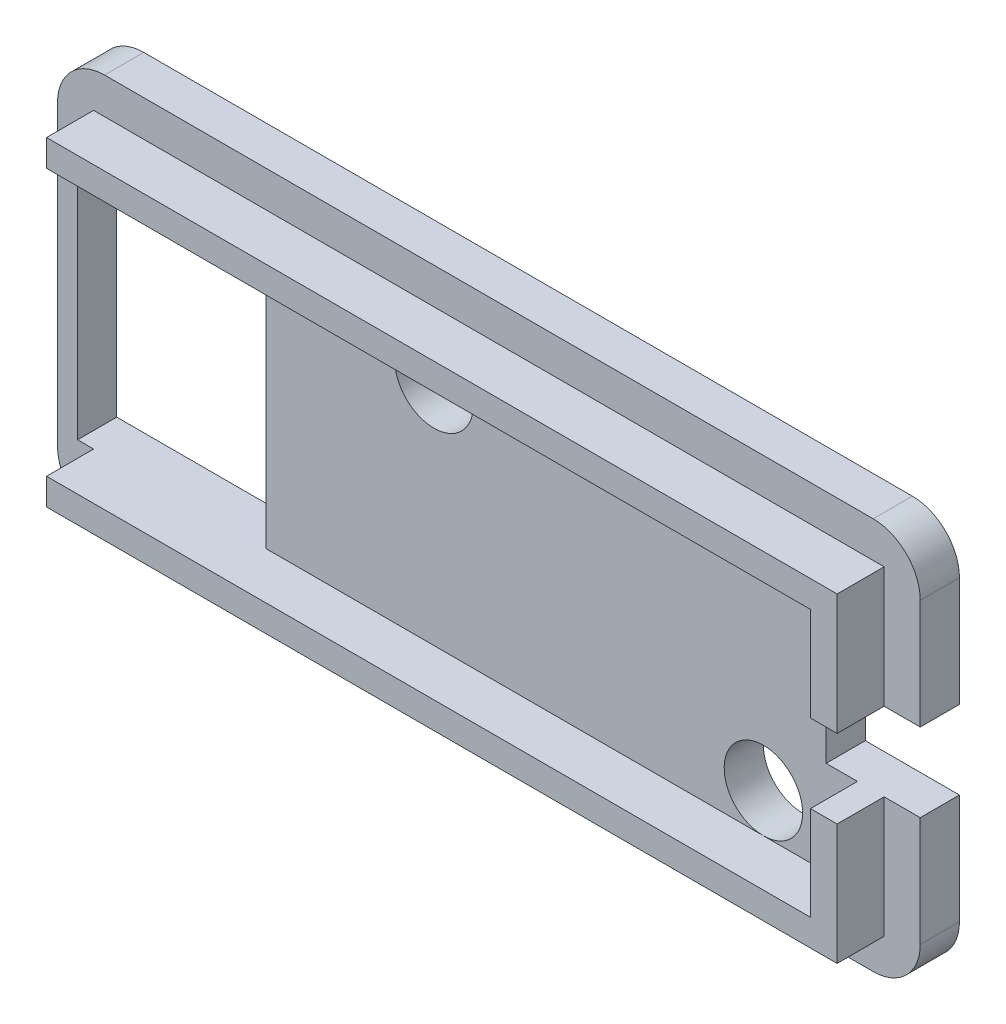
ISO-10303-21;
HEADER;
FILE_DESCRIPTION(('STEP AP214'),'2;1');
FILE_NAME('part.step','',(''),(''),'','','');
FILE_SCHEMA(('AUTOMOTIVE_DESIGN { 1 0 10303 214 1 1 1 1 }'));
ENDSEC;
DATA;
#1=APPLICATION_CONTEXT('core data for automotive mechanical design processes');
#2=APPLICATION_PROTOCOL_DEFINITION('international standard','automotive_design',2000,#1);
#3=PRODUCT_CONTEXT('',#1,'mechanical');
#4=PRODUCT('Part','Part','',(#3));
#5=PRODUCT_RELATED_PRODUCT_CATEGORY('part','',(#4));
#6=PRODUCT_DEFINITION_FORMATION('','',#4);
#7=PRODUCT_DEFINITION_CONTEXT('part definition',#1,'design');
#8=PRODUCT_DEFINITION('design','',#6,#7);
#9=PRODUCT_DEFINITION_SHAPE('','',#8);
#10=(LENGTH_UNIT() NAMED_UNIT(*) SI_UNIT(.MILLI.,.METRE.));
#11=(NAMED_UNIT(*) PLANE_ANGLE_UNIT() SI_UNIT($,.RADIAN.));
#12=(NAMED_UNIT(*) SI_UNIT($,.STERADIAN.) SOLID_ANGLE_UNIT());
#13=UNCERTAINTY_MEASURE_WITH_UNIT(LENGTH_MEASURE(1.E-05),#10,'distance_accuracy_value','');
#14=(GEOMETRIC_REPRESENTATION_CONTEXT(3) GLOBAL_UNCERTAINTY_ASSIGNED_CONTEXT((#13)) GLOBAL_UNIT_ASSIGNED_CONTEXT((#10,
#11,#12)) REPRESENTATION_CONTEXT('',''));
#15=CARTESIAN_POINT('',(0.,0.,0.));
#16=DIRECTION('',(0.,0.,1.));
#17=DIRECTION('',(1.,0.,0.));
#18=AXIS2_PLACEMENT_3D('',#15,#16,#17);
#19=CARTESIAN_POINT('',(0.,0.,5.5));
#20=DIRECTION('',(0.,0.,-1.));
#21=DIRECTION('',(-1.,0.,0.));
#22=AXIS2_PLACEMENT_3D('',#19,#20,#21);
#23=PLANE('',#22);
#24=DIRECTION('',(0.,1.,0.));
#25=VECTOR('',#24,1.);
#26=CARTESIAN_POINT('',(25.2,10.2,5.5));
#27=LINE('',#26,#25);
#28=CARTESIAN_POINT('',(25.2,2.5,5.5));
#29=VERTEX_POINT('',#28);
#30=CARTESIAN_POINT('',(25.2,10.2,5.5));
#31=VERTEX_POINT('',#30);
#32=EDGE_CURVE('E81',#29,#31,#27,.T.);
#33=ORIENTED_EDGE('',*,*,#32,.T.);
#34=DIRECTION('',(-1.,0.,0.));
#35=VECTOR('',#34,1.);
#36=CARTESIAN_POINT('',(-25.2,10.2,5.5));
#37=LINE('',#36,#35);
#38=CARTESIAN_POINT('',(-25.2,10.2,5.5));
#39=VERTEX_POINT('',#38);
#40=EDGE_CURVE('E274',#31,#39,#37,.T.);
#41=ORIENTED_EDGE('',*,*,#40,.T.);
#42=DIRECTION('',(0.,-1.,0.));
#43=VECTOR('',#42,1.);
#44=CARTESIAN_POINT('',(-25.2,10.2,5.5));
#45=LINE('',#44,#43);
#46=CARTESIAN_POINT('',(-25.2,8.5,5.5));
#47=VERTEX_POINT('',#46);
#48=EDGE_CURVE('E301',#39,#47,#45,.T.);
#49=ORIENTED_EDGE('',*,*,#48,.T.);
#50=DIRECTION('',(1.,0.,0.));
#51=VECTOR('',#50,1.);
#52=CARTESIAN_POINT('',(-23.5,8.5,5.5));
#53=LINE('',#52,#51);
#54=CARTESIAN_POINT('',(23.5,8.5,5.5));
#55=VERTEX_POINT('',#54);
#56=EDGE_CURVE('E416',#47,#55,#53,.T.);
#57=ORIENTED_EDGE('',*,*,#56,.T.);
#58=DIRECTION('',(0.,-1.,0.));
#59=VECTOR('',#58,1.);
#60=CARTESIAN_POINT('',(23.5,8.5,5.5));
#61=LINE('',#60,#59);
#62=CARTESIAN_POINT('',(23.5,2.5,5.5));
#63=VERTEX_POINT('',#62);
#64=EDGE_CURVE('E421',#55,#63,#61,.T.);
#65=ORIENTED_EDGE('',*,*,#64,.T.);
#66=DIRECTION('',(1.,0.,0.));
#67=VECTOR('',#66,1.);
#68=CARTESIAN_POINT('',(0.,2.5,5.5));
#69=LINE('',#68,#67);
#70=EDGE_CURVE('E372',#63,#29,#69,.T.);
#71=ORIENTED_EDGE('',*,*,#70,.T.);
#72=EDGE_LOOP('',(#33,#41,#49,#57,#65,#71));
#73=FACE_BOUND('',#72,.T.);
#74=ADVANCED_FACE('F65',(#73),#23,.F.);
#75=CARTESIAN_POINT('',(25.2,-10.2,5.5));
#76=VERTEX_POINT('',#75);
#77=CARTESIAN_POINT('',(25.2,-2.5,5.5));
#78=VERTEX_POINT('',#77);
#79=EDGE_CURVE('E294',#76,#78,#27,.T.);
#80=ORIENTED_EDGE('',*,*,#79,.T.);
#81=DIRECTION('',(-1.,0.,0.));
#82=VECTOR('',#81,1.);
#83=CARTESIAN_POINT('',(0.,-2.5,5.5));
#84=LINE('',#83,#82);
#85=CARTESIAN_POINT('',(23.5,-2.5,5.5));
#86=VERTEX_POINT('',#85);
#87=EDGE_CURVE('E363',#78,#86,#84,.T.);
#88=ORIENTED_EDGE('',*,*,#87,.T.);
#89=CARTESIAN_POINT('',(23.5,-8.5,5.5));
#90=VERTEX_POINT('',#89);
#91=EDGE_CURVE('E419',#86,#90,#61,.T.);
#92=ORIENTED_EDGE('',*,*,#91,.T.);
#93=DIRECTION('',(1.,0.,0.));
#94=VECTOR('',#93,1.);
#95=CARTESIAN_POINT('',(-23.5,-8.5,5.5));
#96=LINE('',#95,#94);
#97=CARTESIAN_POINT('',(-25.2,-8.5,5.5));
#98=VERTEX_POINT('',#97);
#99=EDGE_CURVE('E425',#98,#90,#96,.T.);
#100=ORIENTED_EDGE('',*,*,#99,.F.);
#101=CARTESIAN_POINT('',(-25.2,-10.2,5.5));
#102=VERTEX_POINT('',#101);
#103=EDGE_CURVE('E300',#98,#102,#45,.T.);
#104=ORIENTED_EDGE('',*,*,#103,.T.);
#105=DIRECTION('',(1.,0.,0.));
#106=VECTOR('',#105,1.);
#107=CARTESIAN_POINT('',(-25.2,-10.2,5.5));
#108=LINE('',#107,#106);
#109=EDGE_CURVE('E267',#102,#76,#108,.T.);
#110=ORIENTED_EDGE('',*,*,#109,.T.);
#111=EDGE_LOOP('',(#80,#88,#92,#100,#104,#110));
#112=FACE_BOUND('',#111,.T.);
#113=ADVANCED_FACE('F563',(#112),#23,.F.);
#114=CARTESIAN_POINT('',(-23.5,8.5,5.5));
#115=DIRECTION('',(0.,1.,0.));
#116=DIRECTION('',(0.,0.,1.));
#117=AXIS2_PLACEMENT_3D('',#114,#115,#116);
#118=PLANE('',#117);
#119=DIRECTION('',(0.,0.,1.));
#120=VECTOR('',#119,1.);
#121=CARTESIAN_POINT('',(-25.2,8.5,5.5));
#122=LINE('',#121,#120);
#123=CARTESIAN_POINT('',(-25.2,8.5,2.5));
#124=VERTEX_POINT('',#123);
#125=EDGE_CURVE('E318',#124,#47,#122,.T.);
#126=ORIENTED_EDGE('',*,*,#125,.F.);
#127=DIRECTION('',(-1.,0.,0.));
#128=VECTOR('',#127,1.);
#129=CARTESIAN_POINT('',(0.,8.5,2.5));
#130=LINE('',#129,#128);
#131=CARTESIAN_POINT('',(-26.2250049917796,8.5,2.5));
#132=VERTEX_POINT('',#131);
#133=EDGE_CURVE('E394',#124,#132,#130,.T.);
#134=ORIENTED_EDGE('',*,*,#133,.T.);
#135=DIRECTION('',(0.,0.,-1.));
#136=VECTOR('',#135,1.);
#137=CARTESIAN_POINT('',(-26.2250049917796,8.5,13.5));
#138=LINE('',#137,#136);
#139=CARTESIAN_POINT('',(-26.2250049917796,8.5,0.));
#140=VERTEX_POINT('',#139);
#141=EDGE_CURVE('E379',#132,#140,#138,.T.);
#142=ORIENTED_EDGE('',*,*,#141,.T.);
#143=DIRECTION('',(-1.,0.,0.));
#144=VECTOR('',#143,1.);
#145=CARTESIAN_POINT('',(0.,8.5,0.));
#146=LINE('',#145,#144);
#147=CARTESIAN_POINT('',(-14.2250049917796,8.5,0.));
#148=VERTEX_POINT('',#147);
#149=EDGE_CURVE('E397',#148,#140,#146,.T.);
#150=ORIENTED_EDGE('',*,*,#149,.F.);
#151=DIRECTION('',(0.,0.,-1.));
#152=VECTOR('',#151,1.);
#153=CARTESIAN_POINT('',(-14.2250049917796,8.5,13.5));
#154=LINE('',#153,#152);
#155=CARTESIAN_POINT('',(-14.2250049917796,8.5,2.5));
#156=VERTEX_POINT('',#155);
#157=EDGE_CURVE('E382',#156,#148,#154,.T.);
#158=ORIENTED_EDGE('',*,*,#157,.F.);
#159=DIRECTION('',(1.,0.,0.));
#160=VECTOR('',#159,1.);
#161=CARTESIAN_POINT('',(-23.5,8.5,2.5));
#162=LINE('',#161,#160);
#163=CARTESIAN_POINT('',(-3.49999999999999,8.5,2.5));
#164=VERTEX_POINT('',#163);
#165=EDGE_CURVE('E429',#156,#164,#162,.T.);
#166=ORIENTED_EDGE('',*,*,#165,.T.);
#167=CARTESIAN_POINT('',(23.5,8.5,2.5));
#168=VERTEX_POINT('',#167);
#169=EDGE_CURVE('E415',#164,#168,#162,.T.);
#170=ORIENTED_EDGE('',*,*,#169,.T.);
#171=DIRECTION('',(0.,0.,-1.));
#172=VECTOR('',#171,1.);
#173=CARTESIAN_POINT('',(23.5,8.5,5.5));
#174=LINE('',#173,#172);
#175=EDGE_CURVE('E428',#55,#168,#174,.T.);
#176=ORIENTED_EDGE('',*,*,#175,.F.);
#177=ORIENTED_EDGE('',*,*,#56,.F.);
#178=EDGE_LOOP('',(#126,#134,#142,#150,#158,#166,#170,#176,#177));
#179=FACE_BOUND('',#178,.T.);
#180=ADVANCED_FACE('F586',(#179),#118,.F.);
#181=CARTESIAN_POINT('',(-23.5,-8.5,5.5));
#182=DIRECTION('',(0.,1.,0.));
#183=DIRECTION('',(-1.,0.,0.));
#184=AXIS2_PLACEMENT_3D('',#181,#182,#183);
#185=PLANE('',#184);
#186=DIRECTION('',(1.,0.,0.));
#187=VECTOR('',#186,1.);
#188=CARTESIAN_POINT('',(0.,-8.5,2.5));
#189=LINE('',#188,#187);
#190=CARTESIAN_POINT('',(-26.2250049917796,-8.5,2.5));
#191=VERTEX_POINT('',#190);
#192=CARTESIAN_POINT('',(-25.2,-8.5,2.5));
#193=VERTEX_POINT('',#192);
#194=EDGE_CURVE('E405',#191,#193,#189,.T.);
#195=ORIENTED_EDGE('',*,*,#194,.T.);
#196=DIRECTION('',(0.,0.,1.));
#197=VECTOR('',#196,1.);
#198=CARTESIAN_POINT('',(-25.2,-8.5,5.5));
#199=LINE('',#198,#197);
#200=EDGE_CURVE('E12',#193,#98,#199,.T.);
#201=ORIENTED_EDGE('',*,*,#200,.T.);
#202=ORIENTED_EDGE('',*,*,#99,.T.);
#203=DIRECTION('',(0.,0.,-1.));
#204=VECTOR('',#203,1.);
#205=CARTESIAN_POINT('',(23.5,-8.5,5.5));
#206=LINE('',#205,#204);
#207=CARTESIAN_POINT('',(23.5,-8.5,2.5));
#208=VERTEX_POINT('',#207);
#209=EDGE_CURVE('E442',#90,#208,#206,.T.);
#210=ORIENTED_EDGE('',*,*,#209,.T.);
#211=DIRECTION('',(1.,0.,0.));
#212=VECTOR('',#211,1.);
#213=CARTESIAN_POINT('',(-23.5,-8.5,2.5));
#214=LINE('',#213,#212);
#215=CARTESIAN_POINT('',(17.5,-8.5,2.5));
#216=VERTEX_POINT('',#215);
#217=EDGE_CURVE('E438',#216,#208,#214,.T.);
#218=ORIENTED_EDGE('',*,*,#217,.F.);
#219=CARTESIAN_POINT('',(-14.2250049917796,-8.5,2.5));
#220=VERTEX_POINT('',#219);
#221=EDGE_CURVE('E420',#220,#216,#214,.T.);
#222=ORIENTED_EDGE('',*,*,#221,.F.);
#223=DIRECTION('',(0.,0.,-1.));
#224=VECTOR('',#223,1.);
#225=CARTESIAN_POINT('',(-14.2250049917796,-8.5,13.5));
#226=LINE('',#225,#224);
#227=CARTESIAN_POINT('',(-14.2250049917796,-8.5,0.));
#228=VERTEX_POINT('',#227);
#229=EDGE_CURVE('E386',#220,#228,#226,.T.);
#230=ORIENTED_EDGE('',*,*,#229,.T.);
#231=DIRECTION('',(1.,0.,0.));
#232=VECTOR('',#231,1.);
#233=CARTESIAN_POINT('',(0.,-8.5,0.));
#234=LINE('',#233,#232);
#235=CARTESIAN_POINT('',(-26.2250049917796,-8.5,0.));
#236=VERTEX_POINT('',#235);
#237=EDGE_CURVE('E408',#236,#228,#234,.T.);
#238=ORIENTED_EDGE('',*,*,#237,.F.);
#239=DIRECTION('',(0.,0.,-1.));
#240=VECTOR('',#239,1.);
#241=CARTESIAN_POINT('',(-26.2250049917796,-8.5,13.5));
#242=LINE('',#241,#240);
#243=EDGE_CURVE('E390',#191,#236,#242,.T.);
#244=ORIENTED_EDGE('',*,*,#243,.F.);
#245=EDGE_LOOP('',(#195,#201,#202,#210,#218,#222,#230,#238,#244));
#246=FACE_BOUND('',#245,.T.);
#247=ADVANCED_FACE('F608',(#246),#185,.T.);
#248=CARTESIAN_POINT('',(21.5,2.5,8.));
#249=DIRECTION('',(0.,1.,0.));
#250=DIRECTION('',(-1.,0.,0.));
#251=AXIS2_PLACEMENT_3D('',#248,#249,#250);
#252=PLANE('',#251);
#253=DIRECTION('',(1.,0.,0.));
#254=VECTOR('',#253,1.);
#255=CARTESIAN_POINT('',(0.,2.5,2.5));
#256=LINE('',#255,#254);
#257=CARTESIAN_POINT('',(25.2,2.5,2.5));
#258=VERTEX_POINT('',#257);
#259=CARTESIAN_POINT('',(27.5,2.49999999999999,2.5));
#260=VERTEX_POINT('',#259);
#261=EDGE_CURVE('E376',#258,#260,#256,.T.);
#262=ORIENTED_EDGE('',*,*,#261,.F.);
#263=DIRECTION('',(0.,0.,-1.));
#264=VECTOR('',#263,1.);
#265=CARTESIAN_POINT('',(25.2,2.5,8.));
#266=LINE('',#265,#264);
#267=EDGE_CURVE('E262',#29,#258,#266,.T.);
#268=ORIENTED_EDGE('',*,*,#267,.F.);
#269=ORIENTED_EDGE('',*,*,#70,.F.);
#270=DIRECTION('',(0.,0.,1.));
#271=VECTOR('',#270,1.);
#272=CARTESIAN_POINT('',(23.5,2.5,5.5));
#273=LINE('',#272,#271);
#274=CARTESIAN_POINT('',(23.5,2.5,2.5));
#275=VERTEX_POINT('',#274);
#276=EDGE_CURVE('E548',#275,#63,#273,.T.);
#277=ORIENTED_EDGE('',*,*,#276,.F.);
#278=DIRECTION('',(1.,0.,0.));
#279=VECTOR('',#278,1.);
#280=CARTESIAN_POINT('',(0.,2.5,2.5));
#281=LINE('',#280,#279);
#282=CARTESIAN_POINT('',(21.5,2.5,2.5));
#283=VERTEX_POINT('',#282);
#284=EDGE_CURVE('E368',#283,#275,#281,.T.);
#285=ORIENTED_EDGE('',*,*,#284,.F.);
#286=DIRECTION('',(0.,0.,-1.));
#287=VECTOR('',#286,1.);
#288=CARTESIAN_POINT('',(21.5,2.5,8.));
#289=LINE('',#288,#287);
#290=CARTESIAN_POINT('',(21.5,2.5,0.));
#291=VERTEX_POINT('',#290);
#292=EDGE_CURVE('E352',#283,#291,#289,.T.);
#293=ORIENTED_EDGE('',*,*,#292,.T.);
#294=DIRECTION('',(1.,0.,0.));
#295=VECTOR('',#294,1.);
#296=CARTESIAN_POINT('',(21.5,2.5,0.));
#297=LINE('',#296,#295);
#298=CARTESIAN_POINT('',(27.5,2.49999999999999,0.));
#299=VERTEX_POINT('',#298);
#300=EDGE_CURVE('E343',#291,#299,#297,.T.);
#301=ORIENTED_EDGE('',*,*,#300,.T.);
#302=DIRECTION('',(0.,0.,-1.));
#303=VECTOR('',#302,1.);
#304=CARTESIAN_POINT('',(27.5,2.49999999999999,8.));
#305=LINE('',#304,#303);
#306=EDGE_CURVE('E347',#260,#299,#305,.T.);
#307=ORIENTED_EDGE('',*,*,#306,.F.);
#308=EDGE_LOOP('',(#262,#268,#269,#277,#285,#293,#301,#307));
#309=FACE_BOUND('',#308,.T.);
#310=ADVANCED_FACE('F694',(#309),#252,.F.);
#311=CARTESIAN_POINT('',(21.5,-2.5,8.));
#312=DIRECTION('',(0.,-1.,0.));
#313=DIRECTION('',(1.,0.,0.));
#314=AXIS2_PLACEMENT_3D('',#311,#312,#313);
#315=PLANE('',#314);
#316=DIRECTION('',(0.,0.,1.));
#317=VECTOR('',#316,1.);
#318=CARTESIAN_POINT('',(25.2,-2.5,8.));
#319=LINE('',#318,#317);
#320=CARTESIAN_POINT('',(25.2,-2.5,2.5));
#321=VERTEX_POINT('',#320);
#322=EDGE_CURVE('E74',#321,#78,#319,.T.);
#323=ORIENTED_EDGE('',*,*,#322,.F.);
#324=DIRECTION('',(-1.,0.,0.));
#325=VECTOR('',#324,1.);
#326=CARTESIAN_POINT('',(0.,-2.5,2.5));
#327=LINE('',#326,#325);
#328=CARTESIAN_POINT('',(27.5,-2.50000000000001,2.5));
#329=VERTEX_POINT('',#328);
#330=EDGE_CURVE('E89',#329,#321,#327,.T.);
#331=ORIENTED_EDGE('',*,*,#330,.F.);
#332=DIRECTION('',(0.,0.,-1.));
#333=VECTOR('',#332,1.);
#334=CARTESIAN_POINT('',(27.5,-2.50000000000001,8.));
#335=LINE('',#334,#333);
#336=CARTESIAN_POINT('',(27.5,-2.50000000000001,0.));
#337=VERTEX_POINT('',#336);
#338=EDGE_CURVE('E346',#329,#337,#335,.T.);
#339=ORIENTED_EDGE('',*,*,#338,.T.);
#340=DIRECTION('',(-1.,0.,0.));
#341=VECTOR('',#340,1.);
#342=CARTESIAN_POINT('',(21.5,-2.5,0.));
#343=LINE('',#342,#341);
#344=CARTESIAN_POINT('',(21.5,-2.5,0.));
#345=VERTEX_POINT('',#344);
#346=EDGE_CURVE('E326',#337,#345,#343,.T.);
#347=ORIENTED_EDGE('',*,*,#346,.T.);
#348=DIRECTION('',(0.,0.,-1.));
#349=VECTOR('',#348,1.);
#350=CARTESIAN_POINT('',(21.5,-2.5,8.));
#351=LINE('',#350,#349);
#352=CARTESIAN_POINT('',(21.5,-2.5,2.5));
#353=VERTEX_POINT('',#352);
#354=EDGE_CURVE('E355',#353,#345,#351,.T.);
#355=ORIENTED_EDGE('',*,*,#354,.F.);
#356=DIRECTION('',(-1.,0.,0.));
#357=VECTOR('',#356,1.);
#358=CARTESIAN_POINT('',(0.,-2.5,2.5));
#359=LINE('',#358,#357);
#360=CARTESIAN_POINT('',(23.5,-2.5,2.5));
#361=VERTEX_POINT('',#360);
#362=EDGE_CURVE('E351',#361,#353,#359,.T.);
#363=ORIENTED_EDGE('',*,*,#362,.F.);
#364=DIRECTION('',(0.,0.,-1.));
#365=VECTOR('',#364,1.);
#366=CARTESIAN_POINT('',(23.5,-2.5,5.5));
#367=LINE('',#366,#365);
#368=EDGE_CURVE('E544',#86,#361,#367,.T.);
#369=ORIENTED_EDGE('',*,*,#368,.F.);
#370=ORIENTED_EDGE('',*,*,#87,.F.);
#371=EDGE_LOOP('',(#323,#331,#339,#347,#355,#363,#369,#370));
#372=FACE_BOUND('',#371,.T.);
#373=ADVANCED_FACE('F568',(#372),#315,.F.);
#374=CARTESIAN_POINT('',(27.5,12.5,2.5));
#375=DIRECTION('',(1.,0.,0.));
#376=DIRECTION('',(0.,0.,-1.));
#377=AXIS2_PLACEMENT_3D('',#374,#375,#376);
#378=PLANE('',#377);
#379=ORIENTED_EDGE('',*,*,#306,.T.);
#380=DIRECTION('',(0.,-1.,0.));
#381=VECTOR('',#380,1.);
#382=CARTESIAN_POINT('',(27.5,12.5,0.));
#383=LINE('',#382,#381);
#384=CARTESIAN_POINT('',(27.5,9.5,0.));
#385=VERTEX_POINT('',#384);
#386=EDGE_CURVE('E473',#385,#299,#383,.T.);
#387=ORIENTED_EDGE('',*,*,#386,.F.);
#388=DIRECTION('',(0.,0.,-1.));
#389=VECTOR('',#388,1.);
#390=CARTESIAN_POINT('',(27.5,9.5,2.5));
#391=LINE('',#390,#389);
#392=CARTESIAN_POINT('',(27.5,9.5,2.5));
#393=VERTEX_POINT('',#392);
#394=EDGE_CURVE('E529',#385,#393,#391,.F.);
#395=ORIENTED_EDGE('',*,*,#394,.T.);
#396=DIRECTION('',(0.,-1.,0.));
#397=VECTOR('',#396,1.);
#398=CARTESIAN_POINT('',(27.5,12.5,2.5));
#399=LINE('',#398,#397);
#400=EDGE_CURVE('E456',#393,#260,#399,.T.);
#401=ORIENTED_EDGE('',*,*,#400,.T.);
#402=EDGE_LOOP('',(#379,#387,#395,#401));
#403=FACE_BOUND('',#402,.T.);
#404=ADVANCED_FACE('F649',(#403),#378,.T.);
#405=CARTESIAN_POINT('',(23.5,8.5,5.5));
#406=DIRECTION('',(1.,0.,0.));
#407=DIRECTION('',(0.,0.,-1.));
#408=AXIS2_PLACEMENT_3D('',#405,#406,#407);
#409=PLANE('',#408);
#410=DIRECTION('',(0.,-1.,0.));
#411=VECTOR('',#410,1.);
#412=CARTESIAN_POINT('',(23.5,8.5,2.5));
#413=LINE('',#412,#411);
#414=EDGE_CURVE('E434',#168,#275,#413,.T.);
#415=ORIENTED_EDGE('',*,*,#414,.T.);
#416=ORIENTED_EDGE('',*,*,#276,.T.);
#417=ORIENTED_EDGE('',*,*,#64,.F.);
#418=ORIENTED_EDGE('',*,*,#175,.T.);
#419=EDGE_LOOP('',(#415,#416,#417,#418));
#420=FACE_BOUND('',#419,.T.);
#421=ADVANCED_FACE('F594',(#420),#409,.F.);
#422=CARTESIAN_POINT('',(0.,0.,2.5));
#423=DIRECTION('',(0.,0.,-1.));
#424=DIRECTION('',(-1.,0.,0.));
#425=AXIS2_PLACEMENT_3D('',#422,#423,#424);
#426=PLANE('',#425);
#427=DIRECTION('',(0.,1.,0.));
#428=VECTOR('',#427,1.);
#429=CARTESIAN_POINT('',(25.2,10.2,2.5));
#430=LINE('',#429,#428);
#431=CARTESIAN_POINT('',(25.2,10.2,2.5));
#432=VERTEX_POINT('',#431);
#433=EDGE_CURVE('E257',#258,#432,#430,.T.);
#434=ORIENTED_EDGE('',*,*,#433,.F.);
#435=ORIENTED_EDGE('',*,*,#261,.T.);
#436=ORIENTED_EDGE('',*,*,#400,.F.);
#437=CARTESIAN_POINT('',(24.5,9.5,2.5));
#438=DIRECTION('',(0.,0.,-1.));
#439=DIRECTION('',(-1.,0.,0.));
#440=AXIS2_PLACEMENT_3D('',#437,#438,#439);
#441=CIRCLE('',#440,3.);
#442=CARTESIAN_POINT('',(24.5,12.5,2.5));
#443=VERTEX_POINT('',#442);
#444=EDGE_CURVE('E509',#393,#443,#441,.F.);
#445=ORIENTED_EDGE('',*,*,#444,.T.);
#446=DIRECTION('',(1.,0.,0.));
#447=VECTOR('',#446,1.);
#448=CARTESIAN_POINT('',(-27.5,12.5,2.5));
#449=LINE('',#448,#447);
#450=CARTESIAN_POINT('',(-24.5,12.5,2.5));
#451=VERTEX_POINT('',#450);
#452=EDGE_CURVE('E460',#451,#443,#449,.T.);
#453=ORIENTED_EDGE('',*,*,#452,.F.);
#454=CARTESIAN_POINT('',(-24.5,9.5,2.5));
#455=DIRECTION('',(0.,0.,-1.));
#456=DIRECTION('',(-1.,0.,0.));
#457=AXIS2_PLACEMENT_3D('',#454,#455,#456);
#458=CIRCLE('',#457,3.);
#459=CARTESIAN_POINT('',(-27.5,9.5,2.5));
#460=VERTEX_POINT('',#459);
#461=EDGE_CURVE('E519',#451,#460,#458,.F.);
#462=ORIENTED_EDGE('',*,*,#461,.T.);
#463=DIRECTION('',(0.,-1.,0.));
#464=VECTOR('',#463,1.);
#465=CARTESIAN_POINT('',(-27.5,12.5,2.5));
#466=LINE('',#465,#464);
#467=CARTESIAN_POINT('',(-27.5,-9.5,2.5));
#468=VERTEX_POINT('',#467);
#469=EDGE_CURVE('E464',#460,#468,#466,.T.);
#470=ORIENTED_EDGE('',*,*,#469,.T.);
#471=CARTESIAN_POINT('',(-24.5,-9.5,2.5));
#472=DIRECTION('',(0.,0.,-1.));
#473=DIRECTION('',(-1.,0.,0.));
#474=AXIS2_PLACEMENT_3D('',#471,#472,#473);
#475=CIRCLE('',#474,3.);
#476=CARTESIAN_POINT('',(-24.5,-12.5,2.5));
#477=VERTEX_POINT('',#476);
#478=EDGE_CURVE('E516',#468,#477,#475,.F.);
#479=ORIENTED_EDGE('',*,*,#478,.T.);
#480=DIRECTION('',(1.,0.,0.));
#481=VECTOR('',#480,1.);
#482=CARTESIAN_POINT('',(-27.5,-12.5,2.5));
#483=LINE('',#482,#481);
#484=CARTESIAN_POINT('',(24.5,-12.5,2.5));
#485=VERTEX_POINT('',#484);
#486=EDGE_CURVE('E450',#477,#485,#483,.T.);
#487=ORIENTED_EDGE('',*,*,#486,.T.);
#488=CARTESIAN_POINT('',(24.5,-9.5,2.5));
#489=DIRECTION('',(0.,0.,-1.));
#490=DIRECTION('',(-1.,0.,0.));
#491=AXIS2_PLACEMENT_3D('',#488,#489,#490);
#492=CIRCLE('',#491,3.);
#493=CARTESIAN_POINT('',(27.5,-9.5,2.5));
#494=VERTEX_POINT('',#493);
#495=EDGE_CURVE('E512',#485,#494,#492,.F.);
#496=ORIENTED_EDGE('',*,*,#495,.T.);
#497=EDGE_CURVE('E454',#329,#494,#399,.T.);
#498=ORIENTED_EDGE('',*,*,#497,.F.);
#499=ORIENTED_EDGE('',*,*,#330,.T.);
#500=CARTESIAN_POINT('',(25.2,-10.2,2.5));
#501=VERTEX_POINT('',#500);
#502=EDGE_CURVE('E266',#501,#321,#430,.T.);
#503=ORIENTED_EDGE('',*,*,#502,.F.);
#504=DIRECTION('',(1.,0.,0.));
#505=VECTOR('',#504,1.);
#506=CARTESIAN_POINT('',(-25.2,-10.2,2.5));
#507=LINE('',#506,#505);
#508=CARTESIAN_POINT('',(-25.2,-10.2,2.5));
#509=VERTEX_POINT('',#508);
#510=EDGE_CURVE('E277',#509,#501,#507,.T.);
#511=ORIENTED_EDGE('',*,*,#510,.F.);
#512=DIRECTION('',(0.,-1.,0.));
#513=VECTOR('',#512,1.);
#514=CARTESIAN_POINT('',(-25.2,10.2,2.5));
#515=LINE('',#514,#513);
#516=EDGE_CURVE('E284',#193,#509,#515,.T.);
#517=ORIENTED_EDGE('',*,*,#516,.F.);
#518=ORIENTED_EDGE('',*,*,#194,.F.);
#519=DIRECTION('',(0.,-1.,0.));
#520=VECTOR('',#519,1.);
#521=CARTESIAN_POINT('',(-26.2250049917796,0.,2.5));
#522=LINE('',#521,#520);
#523=EDGE_CURVE('E412',#132,#191,#522,.T.);
#524=ORIENTED_EDGE('',*,*,#523,.F.);
#525=ORIENTED_EDGE('',*,*,#133,.F.);
#526=CARTESIAN_POINT('',(-25.2,10.2,2.5));
#527=VERTEX_POINT('',#526);
#528=EDGE_CURVE('E281',#527,#124,#515,.T.);
#529=ORIENTED_EDGE('',*,*,#528,.F.);
#530=DIRECTION('',(-1.,0.,0.));
#531=VECTOR('',#530,1.);
#532=CARTESIAN_POINT('',(-25.2,10.2,2.5));
#533=LINE('',#532,#531);
#534=EDGE_CURVE('E272',#432,#527,#533,.T.);
#535=ORIENTED_EDGE('',*,*,#534,.F.);
#536=EDGE_LOOP('',(#434,#435,#436,#445,#453,#462,#470,#479,#487,#496,#498,#499,#503,#511,#517,
#518,#524,#525,#529,#535));
#537=FACE_BOUND('',#536,.T.);
#538=ADVANCED_FACE('F279',(#537),#426,.F.);
#539=CARTESIAN_POINT('',(0.,0.,0.));
#540=DIRECTION('',(0.,0.,-1.));
#541=DIRECTION('',(-1.,0.,0.));
#542=AXIS2_PLACEMENT_3D('',#539,#540,#541);
#543=PLANE('',#542);
#544=CARTESIAN_POINT('',(-3.49999999999999,6.,0.));
#545=DIRECTION('',(0.,0.,1.));
#546=DIRECTION('',(1.,0.,0.));
#547=AXIS2_PLACEMENT_3D('',#544,#545,#546);
#548=CIRCLE('',#547,2.5);
#549=CARTESIAN_POINT('',(-0.999999999999987,6.,0.));
#550=VERTEX_POINT('',#549);
#551=EDGE_CURVE('E322',#550,#550,#548,.T.);
#552=ORIENTED_EDGE('',*,*,#551,.T.);
#553=EDGE_LOOP('',(#552));
#554=FACE_BOUND('',#553,.T.);
#555=CARTESIAN_POINT('',(17.5,-6.,0.));
#556=DIRECTION('',(0.,0.,1.));
#557=DIRECTION('',(1.,0.,0.));
#558=AXIS2_PLACEMENT_3D('',#555,#556,#557);
#559=CIRCLE('',#558,2.5);
#560=CARTESIAN_POINT('',(20.,-6.,0.));
#561=VERTEX_POINT('',#560);
#562=EDGE_CURVE('E330',#561,#561,#559,.T.);
#563=ORIENTED_EDGE('',*,*,#562,.T.);
#564=EDGE_LOOP('',(#563));
#565=FACE_BOUND('',#564,.T.);
#566=ORIENTED_EDGE('',*,*,#300,.F.);
#567=DIRECTION('',(0.,1.,0.));
#568=VECTOR('',#567,1.);
#569=CARTESIAN_POINT('',(21.5,-2.5,0.));
#570=LINE('',#569,#568);
#571=EDGE_CURVE('E339',#345,#291,#570,.T.);
#572=ORIENTED_EDGE('',*,*,#571,.F.);
#573=ORIENTED_EDGE('',*,*,#346,.F.);
#574=CARTESIAN_POINT('',(27.5,-9.5,0.));
#575=VERTEX_POINT('',#574);
#576=EDGE_CURVE('E472',#337,#575,#383,.T.);
#577=ORIENTED_EDGE('',*,*,#576,.T.);
#578=CARTESIAN_POINT('',(24.5,-9.5,0.));
#579=DIRECTION('',(0.,0.,-1.));
#580=DIRECTION('',(-1.,0.,0.));
#581=AXIS2_PLACEMENT_3D('',#578,#579,#580);
#582=CIRCLE('',#581,3.);
#583=CARTESIAN_POINT('',(24.5,-12.5,0.));
#584=VERTEX_POINT('',#583);
#585=EDGE_CURVE('E493',#575,#584,#582,.T.);
#586=ORIENTED_EDGE('',*,*,#585,.T.);
#587=DIRECTION('',(1.,0.,0.));
#588=VECTOR('',#587,1.);
#589=CARTESIAN_POINT('',(-27.5,-12.5,0.));
#590=LINE('',#589,#588);
#591=CARTESIAN_POINT('',(-24.5,-12.5,0.));
#592=VERTEX_POINT('',#591);
#593=EDGE_CURVE('E446',#592,#584,#590,.T.);
#594=ORIENTED_EDGE('',*,*,#593,.F.);
#595=CARTESIAN_POINT('',(-24.5,-9.5,0.));
#596=DIRECTION('',(0.,0.,-1.));
#597=DIRECTION('',(-1.,0.,0.));
#598=AXIS2_PLACEMENT_3D('',#595,#596,#597);
#599=CIRCLE('',#598,3.);
#600=CARTESIAN_POINT('',(-27.5,-9.5,0.));
#601=VERTEX_POINT('',#600);
#602=EDGE_CURVE('E496',#592,#601,#599,.T.);
#603=ORIENTED_EDGE('',*,*,#602,.T.);
#604=DIRECTION('',(0.,-1.,0.));
#605=VECTOR('',#604,1.);
#606=CARTESIAN_POINT('',(-27.5,12.5,0.));
#607=LINE('',#606,#605);
#608=CARTESIAN_POINT('',(-27.5,9.5,0.));
#609=VERTEX_POINT('',#608);
#610=EDGE_CURVE('E455',#609,#601,#607,.T.);
#611=ORIENTED_EDGE('',*,*,#610,.F.);
#612=CARTESIAN_POINT('',(-24.5,9.5,0.));
#613=DIRECTION('',(0.,0.,-1.));
#614=DIRECTION('',(-1.,0.,0.));
#615=AXIS2_PLACEMENT_3D('',#612,#613,#614);
#616=CIRCLE('',#615,3.);
#617=CARTESIAN_POINT('',(-24.5,12.5,0.));
#618=VERTEX_POINT('',#617);
#619=EDGE_CURVE('E499',#609,#618,#616,.T.);
#620=ORIENTED_EDGE('',*,*,#619,.T.);
#621=DIRECTION('',(1.,0.,0.));
#622=VECTOR('',#621,1.);
#623=CARTESIAN_POINT('',(-27.5,12.5,0.));
#624=LINE('',#623,#622);
#625=CARTESIAN_POINT('',(24.5,12.5,0.));
#626=VERTEX_POINT('',#625);
#627=EDGE_CURVE('E477',#618,#626,#624,.T.);
#628=ORIENTED_EDGE('',*,*,#627,.T.);
#629=CARTESIAN_POINT('',(24.5,9.5,0.));
#630=DIRECTION('',(0.,0.,-1.));
#631=DIRECTION('',(-1.,0.,0.));
#632=AXIS2_PLACEMENT_3D('',#629,#630,#631);
#633=CIRCLE('',#632,3.);
#634=EDGE_CURVE('E490',#626,#385,#633,.T.);
#635=ORIENTED_EDGE('',*,*,#634,.T.);
#636=ORIENTED_EDGE('',*,*,#386,.T.);
#637=EDGE_LOOP('',(#566,#572,#573,#577,#586,#594,#603,#611,#620,#628,#635,#636));
#638=FACE_BOUND('',#637,.T.);
#639=ORIENTED_EDGE('',*,*,#149,.T.);
#640=DIRECTION('',(0.,-1.,0.));
#641=VECTOR('',#640,1.);
#642=CARTESIAN_POINT('',(-26.2250049917796,0.,0.));
#643=LINE('',#642,#641);
#644=EDGE_CURVE('E540',#140,#236,#643,.T.);
#645=ORIENTED_EDGE('',*,*,#644,.T.);
#646=ORIENTED_EDGE('',*,*,#237,.T.);
#647=DIRECTION('',(0.,1.,0.));
#648=VECTOR('',#647,1.);
#649=CARTESIAN_POINT('',(-14.2250049917796,0.,0.));
#650=LINE('',#649,#648);
#651=EDGE_CURVE('E401',#228,#148,#650,.T.);
#652=ORIENTED_EDGE('',*,*,#651,.T.);
#653=EDGE_LOOP('',(#639,#645,#646,#652));
#654=FACE_BOUND('',#653,.T.);
#655=ADVANCED_FACE('F632',(#554,#565,#638,#654),#543,.T.);
#656=ORIENTED_EDGE('',*,*,#169,.F.);
#657=CARTESIAN_POINT('',(-3.49999999999999,6.,2.5));
#658=DIRECTION('',(0.,0.,1.));
#659=DIRECTION('',(1.,0.,0.));
#660=AXIS2_PLACEMENT_3D('',#657,#658,#659);
#661=CIRCLE('',#660,2.5);
#662=EDGE_CURVE('E327',#164,#164,#661,.T.);
#663=ORIENTED_EDGE('',*,*,#662,.F.);
#664=ORIENTED_EDGE('',*,*,#165,.F.);
#665=DIRECTION('',(0.,1.,0.));
#666=VECTOR('',#665,1.);
#667=CARTESIAN_POINT('',(-14.2250049917796,0.,2.5));
#668=LINE('',#667,#666);
#669=EDGE_CURVE('E536',#220,#156,#668,.T.);
#670=ORIENTED_EDGE('',*,*,#669,.F.);
#671=ORIENTED_EDGE('',*,*,#221,.T.);
#672=CARTESIAN_POINT('',(17.5,-6.,2.5));
#673=DIRECTION('',(0.,0.,1.));
#674=DIRECTION('',(1.,0.,0.));
#675=AXIS2_PLACEMENT_3D('',#672,#673,#674);
#676=CIRCLE('',#675,2.5);
#677=EDGE_CURVE('E321',#216,#216,#676,.T.);
#678=ORIENTED_EDGE('',*,*,#677,.F.);
#679=ORIENTED_EDGE('',*,*,#217,.T.);
#680=EDGE_CURVE('E433',#361,#208,#413,.T.);
#681=ORIENTED_EDGE('',*,*,#680,.F.);
#682=ORIENTED_EDGE('',*,*,#362,.T.);
#683=DIRECTION('',(0.,1.,0.));
#684=VECTOR('',#683,1.);
#685=CARTESIAN_POINT('',(21.5,0.,2.5));
#686=LINE('',#685,#684);
#687=EDGE_CURVE('E552',#353,#283,#686,.T.);
#688=ORIENTED_EDGE('',*,*,#687,.T.);
#689=ORIENTED_EDGE('',*,*,#284,.T.);
#690=ORIENTED_EDGE('',*,*,#414,.F.);
#691=EDGE_LOOP('',(#656,#663,#664,#670,#671,#678,#679,#681,#682,#688,#689,#690));
#692=FACE_BOUND('',#691,.T.);
#693=ADVANCED_FACE('F592',(#692),#426,.F.);
#694=CARTESIAN_POINT('',(-27.5,-12.5,2.5));
#695=DIRECTION('',(0.,1.,0.));
#696=DIRECTION('',(0.,0.,1.));
#697=AXIS2_PLACEMENT_3D('',#694,#695,#696);
#698=PLANE('',#697);
#699=ORIENTED_EDGE('',*,*,#486,.F.);
#700=DIRECTION('',(0.,0.,-1.));
#701=VECTOR('',#700,1.);
#702=CARTESIAN_POINT('',(-24.5,-12.5,2.5));
#703=LINE('',#702,#701);
#704=EDGE_CURVE('E525',#477,#592,#703,.T.);
#705=ORIENTED_EDGE('',*,*,#704,.T.);
#706=ORIENTED_EDGE('',*,*,#593,.T.);
#707=DIRECTION('',(0.,0.,-1.));
#708=VECTOR('',#707,1.);
#709=CARTESIAN_POINT('',(24.5,-12.5,2.5));
#710=LINE('',#709,#708);
#711=EDGE_CURVE('E522',#584,#485,#710,.F.);
#712=ORIENTED_EDGE('',*,*,#711,.T.);
#713=EDGE_LOOP('',(#699,#705,#706,#712));
#714=FACE_BOUND('',#713,.T.);
#715=ADVANCED_FACE('F647',(#714),#698,.F.);
#716=ORIENTED_EDGE('',*,*,#338,.F.);
#717=ORIENTED_EDGE('',*,*,#497,.T.);
#718=DIRECTION('',(0.,0.,-1.));
#719=VECTOR('',#718,1.);
#720=CARTESIAN_POINT('',(27.5,-9.5,0.));
#721=LINE('',#720,#719);
#722=EDGE_CURVE('E532',#494,#575,#721,.T.);
#723=ORIENTED_EDGE('',*,*,#722,.T.);
#724=ORIENTED_EDGE('',*,*,#576,.F.);
#725=EDGE_LOOP('',(#716,#717,#723,#724));
#726=FACE_BOUND('',#725,.T.);
#727=ADVANCED_FACE('F643',(#726),#378,.T.);
#728=CARTESIAN_POINT('',(-27.5,12.5,2.5));
#729=DIRECTION('',(0.,1.,0.));
#730=DIRECTION('',(0.,0.,1.));
#731=AXIS2_PLACEMENT_3D('',#728,#729,#730);
#732=PLANE('',#731);
#733=ORIENTED_EDGE('',*,*,#627,.F.);
#734=DIRECTION('',(0.,0.,-1.));
#735=VECTOR('',#734,1.);
#736=CARTESIAN_POINT('',(-24.5,12.5,2.5));
#737=LINE('',#736,#735);
#738=EDGE_CURVE('E506',#618,#451,#737,.F.);
#739=ORIENTED_EDGE('',*,*,#738,.T.);
#740=ORIENTED_EDGE('',*,*,#452,.T.);
#741=DIRECTION('',(0.,0.,-1.));
#742=VECTOR('',#741,1.);
#743=CARTESIAN_POINT('',(24.5,12.5,2.5));
#744=LINE('',#743,#742);
#745=EDGE_CURVE('E502',#443,#626,#744,.T.);
#746=ORIENTED_EDGE('',*,*,#745,.T.);
#747=EDGE_LOOP('',(#733,#739,#740,#746));
#748=FACE_BOUND('',#747,.T.);
#749=ADVANCED_FACE('F639',(#748),#732,.T.);
#750=CARTESIAN_POINT('',(-27.5,12.5,2.5));
#751=DIRECTION('',(1.,0.,0.));
#752=DIRECTION('',(0.,1.,0.));
#753=AXIS2_PLACEMENT_3D('',#750,#751,#752);
#754=PLANE('',#753);
#755=ORIENTED_EDGE('',*,*,#469,.F.);
#756=DIRECTION('',(0.,0.,-1.));
#757=VECTOR('',#756,1.);
#758=CARTESIAN_POINT('',(-27.5,9.5,0.));
#759=LINE('',#758,#757);
#760=EDGE_CURVE('E486',#460,#609,#759,.T.);
#761=ORIENTED_EDGE('',*,*,#760,.T.);
#762=ORIENTED_EDGE('',*,*,#610,.T.);
#763=DIRECTION('',(0.,0.,-1.));
#764=VECTOR('',#763,1.);
#765=CARTESIAN_POINT('',(-27.5,-9.5,2.5));
#766=LINE('',#765,#764);
#767=EDGE_CURVE('E468',#601,#468,#766,.F.);
#768=ORIENTED_EDGE('',*,*,#767,.T.);
#769=EDGE_LOOP('',(#755,#761,#762,#768));
#770=FACE_BOUND('',#769,.T.);
#771=ADVANCED_FACE('F636',(#770),#754,.F.);
#772=ORIENTED_EDGE('',*,*,#91,.F.);
#773=ORIENTED_EDGE('',*,*,#368,.T.);
#774=ORIENTED_EDGE('',*,*,#680,.T.);
#775=ORIENTED_EDGE('',*,*,#209,.F.);
#776=EDGE_LOOP('',(#772,#773,#774,#775));
#777=FACE_BOUND('',#776,.T.);
#778=ADVANCED_FACE('F575',(#777),#409,.F.);
#779=CARTESIAN_POINT('',(-24.5,9.5,2.5));
#780=DIRECTION('',(0.,0.,1.));
#781=DIRECTION('',(1.,0.,0.));
#782=AXIS2_PLACEMENT_3D('',#779,#780,#781);
#783=CYLINDRICAL_SURFACE('',#782,3.);
#784=ORIENTED_EDGE('',*,*,#461,.F.);
#785=ORIENTED_EDGE('',*,*,#738,.F.);
#786=ORIENTED_EDGE('',*,*,#619,.F.);
#787=ORIENTED_EDGE('',*,*,#760,.F.);
#788=EDGE_LOOP('',(#784,#785,#786,#787));
#789=FACE_BOUND('',#788,.T.);
#790=ADVANCED_FACE('F653',(#789),#783,.T.);
#791=CARTESIAN_POINT('',(-24.5,-9.5,2.5));
#792=DIRECTION('',(0.,0.,-1.));
#793=DIRECTION('',(-1.,0.,0.));
#794=AXIS2_PLACEMENT_3D('',#791,#792,#793);
#795=CYLINDRICAL_SURFACE('',#794,3.);
#796=ORIENTED_EDGE('',*,*,#478,.F.);
#797=ORIENTED_EDGE('',*,*,#767,.F.);
#798=ORIENTED_EDGE('',*,*,#602,.F.);
#799=ORIENTED_EDGE('',*,*,#704,.F.);
#800=EDGE_LOOP('',(#796,#797,#798,#799));
#801=FACE_BOUND('',#800,.T.);
#802=ADVANCED_FACE('F656',(#801),#795,.T.);
#803=CARTESIAN_POINT('',(24.5,-9.5,2.5));
#804=DIRECTION('',(0.,0.,1.));
#805=DIRECTION('',(1.,0.,0.));
#806=AXIS2_PLACEMENT_3D('',#803,#804,#805);
#807=CYLINDRICAL_SURFACE('',#806,3.);
#808=ORIENTED_EDGE('',*,*,#495,.F.);
#809=ORIENTED_EDGE('',*,*,#711,.F.);
#810=ORIENTED_EDGE('',*,*,#585,.F.);
#811=ORIENTED_EDGE('',*,*,#722,.F.);
#812=EDGE_LOOP('',(#808,#809,#810,#811));
#813=FACE_BOUND('',#812,.T.);
#814=ADVANCED_FACE('F659',(#813),#807,.T.);
#815=CARTESIAN_POINT('',(24.5,9.5,2.5));
#816=DIRECTION('',(0.,0.,-1.));
#817=DIRECTION('',(-1.,0.,0.));
#818=AXIS2_PLACEMENT_3D('',#815,#816,#817);
#819=CYLINDRICAL_SURFACE('',#818,3.);
#820=ORIENTED_EDGE('',*,*,#444,.F.);
#821=ORIENTED_EDGE('',*,*,#394,.F.);
#822=ORIENTED_EDGE('',*,*,#634,.F.);
#823=ORIENTED_EDGE('',*,*,#745,.F.);
#824=EDGE_LOOP('',(#820,#821,#822,#823));
#825=FACE_BOUND('',#824,.T.);
#826=ADVANCED_FACE('F67',(#825),#819,.T.);
#827=CARTESIAN_POINT('',(-26.2250049917796,-8.5,13.5));
#828=DIRECTION('',(1.,0.,0.));
#829=DIRECTION('',(0.,0.,-1.));
#830=AXIS2_PLACEMENT_3D('',#827,#828,#829);
#831=PLANE('',#830);
#832=ORIENTED_EDGE('',*,*,#523,.T.);
#833=ORIENTED_EDGE('',*,*,#243,.T.);
#834=ORIENTED_EDGE('',*,*,#644,.F.);
#835=ORIENTED_EDGE('',*,*,#141,.F.);
#836=EDGE_LOOP('',(#832,#833,#834,#835));
#837=FACE_BOUND('',#836,.T.);
#838=ADVANCED_FACE('F666',(#837),#831,.T.);
#839=CARTESIAN_POINT('',(-14.2250049917796,-8.5,13.5));
#840=DIRECTION('',(-1.,0.,0.));
#841=DIRECTION('',(0.,0.,1.));
#842=AXIS2_PLACEMENT_3D('',#839,#840,#841);
#843=PLANE('',#842);
#844=ORIENTED_EDGE('',*,*,#229,.F.);
#845=ORIENTED_EDGE('',*,*,#669,.T.);
#846=ORIENTED_EDGE('',*,*,#157,.T.);
#847=ORIENTED_EDGE('',*,*,#651,.F.);
#848=EDGE_LOOP('',(#844,#845,#846,#847));
#849=FACE_BOUND('',#848,.T.);
#850=ADVANCED_FACE('F709',(#849),#843,.T.);
#851=CARTESIAN_POINT('',(21.5,-2.5,8.));
#852=DIRECTION('',(-1.,0.,0.));
#853=DIRECTION('',(0.,0.,1.));
#854=AXIS2_PLACEMENT_3D('',#851,#852,#853);
#855=PLANE('',#854);
#856=ORIENTED_EDGE('',*,*,#354,.T.);
#857=ORIENTED_EDGE('',*,*,#571,.T.);
#858=ORIENTED_EDGE('',*,*,#292,.F.);
#859=ORIENTED_EDGE('',*,*,#687,.F.);
#860=EDGE_LOOP('',(#856,#857,#858,#859));
#861=FACE_BOUND('',#860,.T.);
#862=ADVANCED_FACE('F700',(#861),#855,.F.);
#863=CARTESIAN_POINT('',(17.5,-6.,0.));
#864=DIRECTION('',(0.,0.,1.));
#865=DIRECTION('',(1.,0.,0.));
#866=AXIS2_PLACEMENT_3D('',#863,#864,#865);
#867=CYLINDRICAL_SURFACE('',#866,2.5);
#868=ORIENTED_EDGE('',*,*,#562,.F.);
#869=EDGE_LOOP('',(#868));
#870=FACE_BOUND('',#869,.T.);
#871=ORIENTED_EDGE('',*,*,#677,.T.);
#872=EDGE_LOOP('',(#871));
#873=FACE_BOUND('',#872,.T.);
#874=ADVANCED_FACE('F737',(#870,#873),#867,.F.);
#875=CARTESIAN_POINT('',(-3.49999999999999,6.,0.));
#876=DIRECTION('',(0.,0.,1.));
#877=DIRECTION('',(1.,0.,0.));
#878=AXIS2_PLACEMENT_3D('',#875,#876,#877);
#879=CYLINDRICAL_SURFACE('',#878,2.5);
#880=ORIENTED_EDGE('',*,*,#551,.F.);
#881=EDGE_LOOP('',(#880));
#882=FACE_BOUND('',#881,.T.);
#883=ORIENTED_EDGE('',*,*,#662,.T.);
#884=EDGE_LOOP('',(#883));
#885=FACE_BOUND('',#884,.T.);
#886=ADVANCED_FACE('F741',(#882,#885),#879,.F.);
#887=CARTESIAN_POINT('',(25.2,10.2,2.5));
#888=DIRECTION('',(1.,0.,0.));
#889=DIRECTION('',(0.,1.,0.));
#890=AXIS2_PLACEMENT_3D('',#887,#888,#889);
#891=PLANE('',#890);
#892=ORIENTED_EDGE('',*,*,#322,.T.);
#893=ORIENTED_EDGE('',*,*,#79,.F.);
#894=DIRECTION('',(0.,0.,1.));
#895=VECTOR('',#894,1.);
#896=CARTESIAN_POINT('',(25.2,-10.2,2.5));
#897=LINE('',#896,#895);
#898=EDGE_CURVE('E308',#501,#76,#897,.T.);
#899=ORIENTED_EDGE('',*,*,#898,.F.);
#900=ORIENTED_EDGE('',*,*,#502,.T.);
#901=EDGE_LOOP('',(#892,#893,#899,#900));
#902=FACE_BOUND('',#901,.T.);
#903=ADVANCED_FACE('F559',(#902),#891,.T.);
#904=CARTESIAN_POINT('',(-25.2,10.2,2.5));
#905=DIRECTION('',(-1.,0.,0.));
#906=DIRECTION('',(0.,-1.,0.));
#907=AXIS2_PLACEMENT_3D('',#904,#905,#906);
#908=PLANE('',#907);
#909=ORIENTED_EDGE('',*,*,#516,.T.);
#910=DIRECTION('',(0.,0.,1.));
#911=VECTOR('',#910,1.);
#912=CARTESIAN_POINT('',(-25.2,-10.2,2.5));
#913=LINE('',#912,#911);
#914=EDGE_CURVE('E311',#509,#102,#913,.T.);
#915=ORIENTED_EDGE('',*,*,#914,.T.);
#916=ORIENTED_EDGE('',*,*,#103,.F.);
#917=ORIENTED_EDGE('',*,*,#200,.F.);
#918=EDGE_LOOP('',(#909,#915,#916,#917));
#919=FACE_BOUND('',#918,.T.);
#920=ADVANCED_FACE('F604',(#919),#908,.T.);
#921=CARTESIAN_POINT('',(-25.2,-10.2,2.5));
#922=DIRECTION('',(0.,-1.,0.));
#923=DIRECTION('',(0.,0.,-1.));
#924=AXIS2_PLACEMENT_3D('',#921,#922,#923);
#925=PLANE('',#924);
#926=ORIENTED_EDGE('',*,*,#109,.F.);
#927=ORIENTED_EDGE('',*,*,#914,.F.);
#928=ORIENTED_EDGE('',*,*,#510,.T.);
#929=ORIENTED_EDGE('',*,*,#898,.T.);
#930=EDGE_LOOP('',(#926,#927,#928,#929));
#931=FACE_BOUND('',#930,.T.);
#932=ADVANCED_FACE('F614',(#931),#925,.T.);
#933=ORIENTED_EDGE('',*,*,#125,.T.);
#934=ORIENTED_EDGE('',*,*,#48,.F.);
#935=DIRECTION('',(0.,0.,1.));
#936=VECTOR('',#935,1.);
#937=CARTESIAN_POINT('',(-25.2,10.2,2.5));
#938=LINE('',#937,#936);
#939=EDGE_CURVE('E276',#527,#39,#938,.T.);
#940=ORIENTED_EDGE('',*,*,#939,.F.);
#941=ORIENTED_EDGE('',*,*,#528,.T.);
#942=EDGE_LOOP('',(#933,#934,#940,#941));
#943=FACE_BOUND('',#942,.T.);
#944=ADVANCED_FACE('F599',(#943),#908,.T.);
#945=ORIENTED_EDGE('',*,*,#267,.T.);
#946=ORIENTED_EDGE('',*,*,#433,.T.);
#947=DIRECTION('',(0.,0.,1.));
#948=VECTOR('',#947,1.);
#949=CARTESIAN_POINT('',(25.2,10.2,2.5));
#950=LINE('',#949,#948);
#951=EDGE_CURVE('E260',#432,#31,#950,.T.);
#952=ORIENTED_EDGE('',*,*,#951,.T.);
#953=ORIENTED_EDGE('',*,*,#32,.F.);
#954=EDGE_LOOP('',(#945,#946,#952,#953));
#955=FACE_BOUND('',#954,.T.);
#956=ADVANCED_FACE('F259',(#955),#891,.T.);
#957=CARTESIAN_POINT('',(-25.2,10.2,2.5));
#958=DIRECTION('',(0.,1.,0.));
#959=DIRECTION('',(0.,0.,1.));
#960=AXIS2_PLACEMENT_3D('',#957,#958,#959);
#961=PLANE('',#960);
#962=ORIENTED_EDGE('',*,*,#40,.F.);
#963=ORIENTED_EDGE('',*,*,#951,.F.);
#964=ORIENTED_EDGE('',*,*,#534,.T.);
#965=ORIENTED_EDGE('',*,*,#939,.T.);
#966=EDGE_LOOP('',(#962,#963,#964,#965));
#967=FACE_BOUND('',#966,.T.);
#968=ADVANCED_FACE('F271',(#967),#961,.T.);
#969=CLOSED_SHELL('',(#74,#113,#180,#247,#310,#373,#404,#421,#538,#655,#693,#715,#727,#749,#771,
#778,#790,#802,#814,#826,#838,#850,#862,#874,#886,#903,#920,#932,#944,#956,#968));
#970=MANIFOLD_SOLID_BREP('B2',#969);
#971=ADVANCED_BREP_SHAPE_REPRESENTATION('',(#18,#970),#14);
#972=SHAPE_DEFINITION_REPRESENTATION(#9,#971);
ENDSEC;
END-ISO-10303-21;
